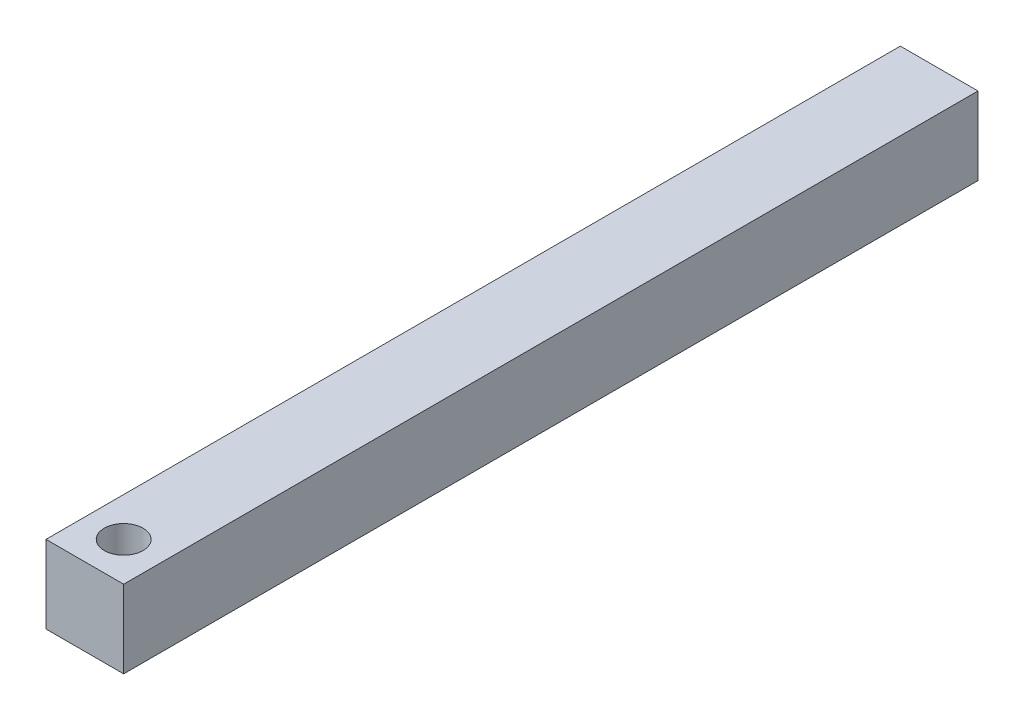
ISO-10303-21;
HEADER;
FILE_DESCRIPTION(('STEP AP214'),'2;1');
FILE_NAME('part.step','',(''),(''),'','','');
FILE_SCHEMA(('AUTOMOTIVE_DESIGN { 1 0 10303 214 1 1 1 1 }'));
ENDSEC;
DATA;
#1=APPLICATION_CONTEXT('core data for automotive mechanical design processes');
#2=APPLICATION_PROTOCOL_DEFINITION('international standard','automotive_design',2000,#1);
#3=PRODUCT_CONTEXT('',#1,'mechanical');
#4=PRODUCT('Part','Part','',(#3));
#5=PRODUCT_RELATED_PRODUCT_CATEGORY('part','',(#4));
#6=PRODUCT_DEFINITION_FORMATION('','',#4);
#7=PRODUCT_DEFINITION_CONTEXT('part definition',#1,'design');
#8=PRODUCT_DEFINITION('design','',#6,#7);
#9=PRODUCT_DEFINITION_SHAPE('','',#8);
#10=(LENGTH_UNIT() NAMED_UNIT(*) SI_UNIT(.MILLI.,.METRE.));
#11=(NAMED_UNIT(*) PLANE_ANGLE_UNIT() SI_UNIT($,.RADIAN.));
#12=(NAMED_UNIT(*) SI_UNIT($,.STERADIAN.) SOLID_ANGLE_UNIT());
#13=UNCERTAINTY_MEASURE_WITH_UNIT(LENGTH_MEASURE(1.E-05),#10,'distance_accuracy_value','');
#14=(GEOMETRIC_REPRESENTATION_CONTEXT(3) GLOBAL_UNCERTAINTY_ASSIGNED_CONTEXT((#13)) GLOBAL_UNIT_ASSIGNED_CONTEXT((#10,
#11,#12)) REPRESENTATION_CONTEXT('',''));
#15=CARTESIAN_POINT('',(0.,0.,0.));
#16=DIRECTION('',(0.,0.,1.));
#17=DIRECTION('',(1.,0.,0.));
#18=AXIS2_PLACEMENT_3D('',#15,#16,#17);
#19=CARTESIAN_POINT('',(0.,0.,279.4));
#20=DIRECTION('',(-1.,0.,0.));
#21=DIRECTION('',(0.,0.,1.));
#22=AXIS2_PLACEMENT_3D('',#19,#20,#21);
#23=PLANE('',#22);
#24=DIRECTION('',(0.,1.,0.));
#25=VECTOR('',#24,1.);
#26=CARTESIAN_POINT('',(0.,0.,0.));
#27=LINE('',#26,#25);
#28=CARTESIAN_POINT('',(0.,0.,0.));
#29=VERTEX_POINT('',#28);
#30=CARTESIAN_POINT('',(0.,25.4,0.));
#31=VERTEX_POINT('',#30);
#32=EDGE_CURVE('E96',#29,#31,#27,.T.);
#33=ORIENTED_EDGE('',*,*,#32,.T.);
#34=DIRECTION('',(0.,0.,-1.));
#35=VECTOR('',#34,1.);
#36=CARTESIAN_POINT('',(0.,25.4,279.4));
#37=LINE('',#36,#35);
#38=CARTESIAN_POINT('',(0.,25.4,279.4));
#39=VERTEX_POINT('',#38);
#40=EDGE_CURVE('E11',#39,#31,#37,.T.);
#41=ORIENTED_EDGE('',*,*,#40,.F.);
#42=DIRECTION('',(0.,1.,0.));
#43=VECTOR('',#42,1.);
#44=CARTESIAN_POINT('',(0.,0.,279.4));
#45=LINE('',#44,#43);
#46=CARTESIAN_POINT('',(0.,0.,279.4));
#47=VERTEX_POINT('',#46);
#48=EDGE_CURVE('E84',#47,#39,#45,.T.);
#49=ORIENTED_EDGE('',*,*,#48,.F.);
#50=DIRECTION('',(0.,0.,-1.));
#51=VECTOR('',#50,1.);
#52=CARTESIAN_POINT('',(0.,0.,279.4));
#53=LINE('',#52,#51);
#54=EDGE_CURVE('E92',#47,#29,#53,.T.);
#55=ORIENTED_EDGE('',*,*,#54,.T.);
#56=EDGE_LOOP('',(#33,#41,#49,#55));
#57=FACE_BOUND('',#56,.T.);
#58=ADVANCED_FACE('F33',(#57),#23,.F.);
#59=CARTESIAN_POINT('',(0.,25.4,279.4));
#60=DIRECTION('',(0.,-1.,0.));
#61=DIRECTION('',(1.,0.,0.));
#62=AXIS2_PLACEMENT_3D('',#59,#60,#61);
#63=PLANE('',#62);
#64=CARTESIAN_POINT('',(-12.7,25.4,266.7));
#65=DIRECTION('',(0.,1.,0.));
#66=DIRECTION('',(-1.,0.,0.));
#67=AXIS2_PLACEMENT_3D('',#64,#65,#66);
#68=CIRCLE('',#67,6.35);
#69=CARTESIAN_POINT('',(-19.05,25.4,266.7));
#70=VERTEX_POINT('',#69);
#71=EDGE_CURVE('E110',#70,#70,#68,.T.);
#72=ORIENTED_EDGE('',*,*,#71,.F.);
#73=EDGE_LOOP('',(#72));
#74=FACE_BOUND('',#73,.T.);
#75=DIRECTION('',(-1.,0.,0.));
#76=VECTOR('',#75,1.);
#77=CARTESIAN_POINT('',(0.,25.4,0.));
#78=LINE('',#77,#76);
#79=CARTESIAN_POINT('',(-25.4,25.4,0.));
#80=VERTEX_POINT('',#79);
#81=EDGE_CURVE('E88',#31,#80,#78,.T.);
#82=ORIENTED_EDGE('',*,*,#81,.T.);
#83=DIRECTION('',(0.,0.,-1.));
#84=VECTOR('',#83,1.);
#85=CARTESIAN_POINT('',(-25.4,25.4,279.4));
#86=LINE('',#85,#84);
#87=CARTESIAN_POINT('',(-25.4,25.4,279.4));
#88=VERTEX_POINT('',#87);
#89=EDGE_CURVE('E41',#88,#80,#86,.T.);
#90=ORIENTED_EDGE('',*,*,#89,.F.);
#91=DIRECTION('',(-1.,0.,0.));
#92=VECTOR('',#91,1.);
#93=CARTESIAN_POINT('',(0.,25.4,279.4));
#94=LINE('',#93,#92);
#95=EDGE_CURVE('E79',#39,#88,#94,.T.);
#96=ORIENTED_EDGE('',*,*,#95,.F.);
#97=ORIENTED_EDGE('',*,*,#40,.T.);
#98=EDGE_LOOP('',(#82,#90,#96,#97));
#99=FACE_BOUND('',#98,.T.);
#100=ADVANCED_FACE('F87',(#74,#99),#63,.F.);
#101=CARTESIAN_POINT('',(-25.4,0.,279.4));
#102=DIRECTION('',(1.,0.,0.));
#103=DIRECTION('',(0.,0.,-1.));
#104=AXIS2_PLACEMENT_3D('',#101,#102,#103);
#105=PLANE('',#104);
#106=DIRECTION('',(0.,-1.,0.));
#107=VECTOR('',#106,1.);
#108=CARTESIAN_POINT('',(-25.4,0.,0.));
#109=LINE('',#108,#107);
#110=CARTESIAN_POINT('',(-25.4,0.,0.));
#111=VERTEX_POINT('',#110);
#112=EDGE_CURVE('E66',#80,#111,#109,.T.);
#113=ORIENTED_EDGE('',*,*,#112,.T.);
#114=DIRECTION('',(0.,0.,-1.));
#115=VECTOR('',#114,1.);
#116=CARTESIAN_POINT('',(-25.4,0.,279.4));
#117=LINE('',#116,#115);
#118=CARTESIAN_POINT('',(-25.4,0.,279.4));
#119=VERTEX_POINT('',#118);
#120=EDGE_CURVE('E89',#119,#111,#117,.T.);
#121=ORIENTED_EDGE('',*,*,#120,.F.);
#122=DIRECTION('',(0.,-1.,0.));
#123=VECTOR('',#122,1.);
#124=CARTESIAN_POINT('',(-25.4,0.,279.4));
#125=LINE('',#124,#123);
#126=EDGE_CURVE('E82',#88,#119,#125,.T.);
#127=ORIENTED_EDGE('',*,*,#126,.F.);
#128=ORIENTED_EDGE('',*,*,#89,.T.);
#129=EDGE_LOOP('',(#113,#121,#127,#128));
#130=FACE_BOUND('',#129,.T.);
#131=ADVANCED_FACE('F90',(#130),#105,.F.);
#132=CARTESIAN_POINT('',(0.,0.,279.4));
#133=DIRECTION('',(0.,1.,0.));
#134=DIRECTION('',(0.,0.,1.));
#135=AXIS2_PLACEMENT_3D('',#132,#133,#134);
#136=PLANE('',#135);
#137=CARTESIAN_POINT('',(-12.7,0.,266.7));
#138=DIRECTION('',(0.,1.,0.));
#139=DIRECTION('',(-1.,0.,0.));
#140=AXIS2_PLACEMENT_3D('',#137,#138,#139);
#141=CIRCLE('',#140,6.35);
#142=CARTESIAN_POINT('',(-19.05,0.,266.7));
#143=VERTEX_POINT('',#142);
#144=EDGE_CURVE('E99',#143,#143,#141,.T.);
#145=ORIENTED_EDGE('',*,*,#144,.T.);
#146=EDGE_LOOP('',(#145));
#147=FACE_BOUND('',#146,.T.);
#148=DIRECTION('',(1.,0.,0.));
#149=VECTOR('',#148,1.);
#150=CARTESIAN_POINT('',(0.,0.,0.));
#151=LINE('',#150,#149);
#152=EDGE_CURVE('E72',#111,#29,#151,.T.);
#153=ORIENTED_EDGE('',*,*,#152,.T.);
#154=ORIENTED_EDGE('',*,*,#54,.F.);
#155=DIRECTION('',(1.,0.,0.));
#156=VECTOR('',#155,1.);
#157=CARTESIAN_POINT('',(0.,0.,279.4));
#158=LINE('',#157,#156);
#159=EDGE_CURVE('E49',#119,#47,#158,.T.);
#160=ORIENTED_EDGE('',*,*,#159,.F.);
#161=ORIENTED_EDGE('',*,*,#120,.T.);
#162=EDGE_LOOP('',(#153,#154,#160,#161));
#163=FACE_BOUND('',#162,.T.);
#164=ADVANCED_FACE('F104',(#147,#163),#136,.F.);
#165=CARTESIAN_POINT('',(0.,0.,279.4));
#166=DIRECTION('',(0.,0.,1.));
#167=DIRECTION('',(1.,0.,0.));
#168=AXIS2_PLACEMENT_3D('',#165,#166,#167);
#169=PLANE('',#168);
#170=ORIENTED_EDGE('',*,*,#48,.T.);
#171=ORIENTED_EDGE('',*,*,#95,.T.);
#172=ORIENTED_EDGE('',*,*,#126,.T.);
#173=ORIENTED_EDGE('',*,*,#159,.T.);
#174=EDGE_LOOP('',(#170,#171,#172,#173));
#175=FACE_BOUND('',#174,.T.);
#176=ADVANCED_FACE('F80',(#175),#169,.T.);
#177=CARTESIAN_POINT('',(0.,0.,0.));
#178=DIRECTION('',(0.,0.,1.));
#179=DIRECTION('',(1.,0.,0.));
#180=AXIS2_PLACEMENT_3D('',#177,#178,#179);
#181=PLANE('',#180);
#182=ORIENTED_EDGE('',*,*,#32,.F.);
#183=ORIENTED_EDGE('',*,*,#152,.F.);
#184=ORIENTED_EDGE('',*,*,#112,.F.);
#185=ORIENTED_EDGE('',*,*,#81,.F.);
#186=EDGE_LOOP('',(#182,#183,#184,#185));
#187=FACE_BOUND('',#186,.T.);
#188=ADVANCED_FACE('F107',(#187),#181,.F.);
#189=CARTESIAN_POINT('',(-12.7,0.,266.7));
#190=DIRECTION('',(0.,1.,0.));
#191=DIRECTION('',(-1.,0.,0.));
#192=AXIS2_PLACEMENT_3D('',#189,#190,#191);
#193=CYLINDRICAL_SURFACE('',#192,6.35);
#194=ORIENTED_EDGE('',*,*,#144,.F.);
#195=EDGE_LOOP('',(#194));
#196=FACE_BOUND('',#195,.T.);
#197=ORIENTED_EDGE('',*,*,#71,.T.);
#198=EDGE_LOOP('',(#197));
#199=FACE_BOUND('',#198,.T.);
#200=ADVANCED_FACE('F117',(#196,#199),#193,.F.);
#201=CLOSED_SHELL('',(#58,#100,#131,#164,#176,#188,#200));
#202=MANIFOLD_SOLID_BREP('B2',#201);
#203=ADVANCED_BREP_SHAPE_REPRESENTATION('',(#18,#202),#14);
#204=SHAPE_DEFINITION_REPRESENTATION(#9,#203);
ENDSEC;
END-ISO-10303-21;
